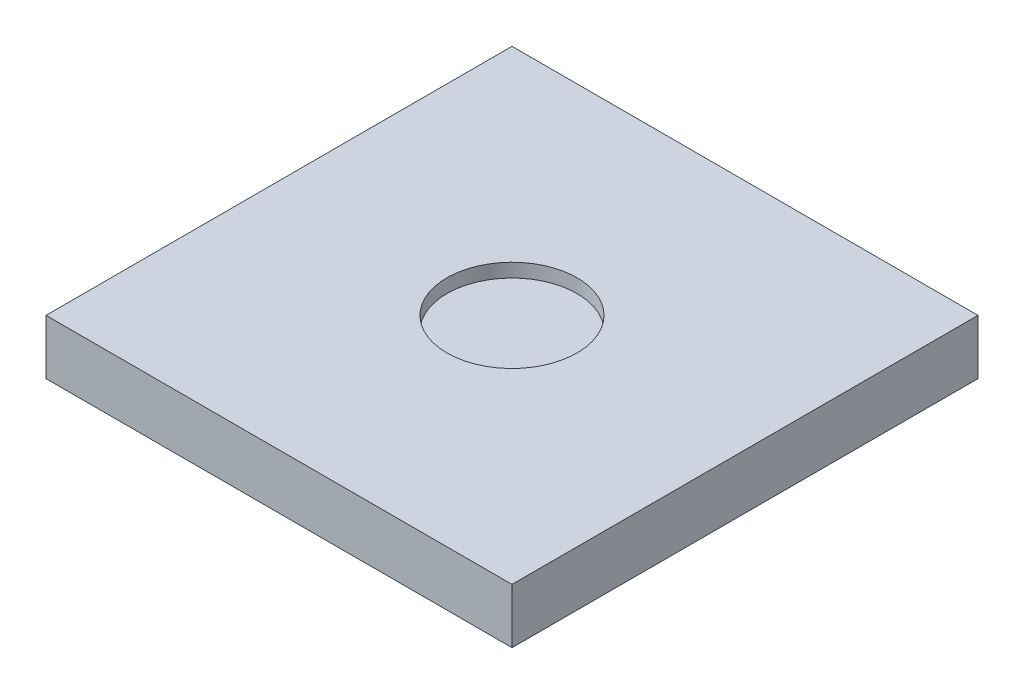
ISO-10303-21;
HEADER;
FILE_DESCRIPTION(('STEP AP214'),'2;1');
FILE_NAME('part.step','',(''),(''),'','','');
FILE_SCHEMA(('AUTOMOTIVE_DESIGN { 1 0 10303 214 1 1 1 1 }'));
ENDSEC;
DATA;
#1=APPLICATION_CONTEXT('core data for automotive mechanical design processes');
#2=APPLICATION_PROTOCOL_DEFINITION('international standard','automotive_design',2000,#1);
#3=PRODUCT_CONTEXT('',#1,'mechanical');
#4=PRODUCT('Part','Part','',(#3));
#5=PRODUCT_RELATED_PRODUCT_CATEGORY('part','',(#4));
#6=PRODUCT_DEFINITION_FORMATION('','',#4);
#7=PRODUCT_DEFINITION_CONTEXT('part definition',#1,'design');
#8=PRODUCT_DEFINITION('design','',#6,#7);
#9=PRODUCT_DEFINITION_SHAPE('','',#8);
#10=(LENGTH_UNIT() NAMED_UNIT(*) SI_UNIT(.MILLI.,.METRE.));
#11=(NAMED_UNIT(*) PLANE_ANGLE_UNIT() SI_UNIT($,.RADIAN.));
#12=(NAMED_UNIT(*) SI_UNIT($,.STERADIAN.) SOLID_ANGLE_UNIT());
#13=UNCERTAINTY_MEASURE_WITH_UNIT(LENGTH_MEASURE(1.E-05),#10,'distance_accuracy_value','');
#14=(GEOMETRIC_REPRESENTATION_CONTEXT(3) GLOBAL_UNCERTAINTY_ASSIGNED_CONTEXT((#13)) GLOBAL_UNIT_ASSIGNED_CONTEXT((#10,
#11,#12)) REPRESENTATION_CONTEXT('',''));
#15=CARTESIAN_POINT('',(0.,0.,0.));
#16=DIRECTION('',(0.,0.,1.));
#17=DIRECTION('',(1.,0.,0.));
#18=AXIS2_PLACEMENT_3D('',#15,#16,#17);
#19=CARTESIAN_POINT('',(-170.,40.,-170.));
#20=DIRECTION('',(1.,0.,0.));
#21=DIRECTION('',(0.,0.,-1.));
#22=AXIS2_PLACEMENT_3D('',#19,#20,#21);
#23=PLANE('',#22);
#24=DIRECTION('',(0.,0.,1.));
#25=VECTOR('',#24,1.);
#26=CARTESIAN_POINT('',(-170.,0.,-170.));
#27=LINE('',#26,#25);
#28=CARTESIAN_POINT('',(-170.,0.,-170.));
#29=VERTEX_POINT('',#28);
#30=CARTESIAN_POINT('',(-170.,0.,170.));
#31=VERTEX_POINT('',#30);
#32=EDGE_CURVE('E96',#29,#31,#27,.T.);
#33=ORIENTED_EDGE('',*,*,#32,.T.);
#34=DIRECTION('',(0.,-1.,0.));
#35=VECTOR('',#34,1.);
#36=CARTESIAN_POINT('',(-170.,40.,170.));
#37=LINE('',#36,#35);
#38=CARTESIAN_POINT('',(-170.,40.,170.));
#39=VERTEX_POINT('',#38);
#40=EDGE_CURVE('E11',#39,#31,#37,.T.);
#41=ORIENTED_EDGE('',*,*,#40,.F.);
#42=DIRECTION('',(0.,0.,1.));
#43=VECTOR('',#42,1.);
#44=CARTESIAN_POINT('',(-170.,40.,-170.));
#45=LINE('',#44,#43);
#46=CARTESIAN_POINT('',(-170.,40.,-170.));
#47=VERTEX_POINT('',#46);
#48=EDGE_CURVE('E84',#47,#39,#45,.T.);
#49=ORIENTED_EDGE('',*,*,#48,.F.);
#50=DIRECTION('',(0.,-1.,0.));
#51=VECTOR('',#50,1.);
#52=CARTESIAN_POINT('',(-170.,40.,-170.));
#53=LINE('',#52,#51);
#54=EDGE_CURVE('E92',#47,#29,#53,.T.);
#55=ORIENTED_EDGE('',*,*,#54,.T.);
#56=EDGE_LOOP('',(#33,#41,#49,#55));
#57=FACE_BOUND('',#56,.T.);
#58=ADVANCED_FACE('F33',(#57),#23,.F.);
#59=CARTESIAN_POINT('',(170.,40.,170.));
#60=DIRECTION('',(0.,0.,-1.));
#61=DIRECTION('',(-1.,0.,0.));
#62=AXIS2_PLACEMENT_3D('',#59,#60,#61);
#63=PLANE('',#62);
#64=DIRECTION('',(1.,0.,0.));
#65=VECTOR('',#64,1.);
#66=CARTESIAN_POINT('',(170.,0.,170.));
#67=LINE('',#66,#65);
#68=CARTESIAN_POINT('',(170.,0.,170.));
#69=VERTEX_POINT('',#68);
#70=EDGE_CURVE('E88',#31,#69,#67,.T.);
#71=ORIENTED_EDGE('',*,*,#70,.T.);
#72=DIRECTION('',(0.,-1.,0.));
#73=VECTOR('',#72,1.);
#74=CARTESIAN_POINT('',(170.,40.,170.));
#75=LINE('',#74,#73);
#76=CARTESIAN_POINT('',(170.,40.,170.));
#77=VERTEX_POINT('',#76);
#78=EDGE_CURVE('E41',#77,#69,#75,.T.);
#79=ORIENTED_EDGE('',*,*,#78,.F.);
#80=DIRECTION('',(1.,0.,0.));
#81=VECTOR('',#80,1.);
#82=CARTESIAN_POINT('',(170.,40.,170.));
#83=LINE('',#82,#81);
#84=EDGE_CURVE('E79',#39,#77,#83,.T.);
#85=ORIENTED_EDGE('',*,*,#84,.F.);
#86=ORIENTED_EDGE('',*,*,#40,.T.);
#87=EDGE_LOOP('',(#71,#79,#85,#86));
#88=FACE_BOUND('',#87,.T.);
#89=ADVANCED_FACE('F87',(#88),#63,.F.);
#90=CARTESIAN_POINT('',(170.,40.,-170.));
#91=DIRECTION('',(-1.,0.,0.));
#92=DIRECTION('',(0.,0.,1.));
#93=AXIS2_PLACEMENT_3D('',#90,#91,#92);
#94=PLANE('',#93);
#95=DIRECTION('',(0.,0.,-1.));
#96=VECTOR('',#95,1.);
#97=CARTESIAN_POINT('',(170.,0.,-170.));
#98=LINE('',#97,#96);
#99=CARTESIAN_POINT('',(170.,0.,-170.));
#100=VERTEX_POINT('',#99);
#101=EDGE_CURVE('E66',#69,#100,#98,.T.);
#102=ORIENTED_EDGE('',*,*,#101,.T.);
#103=DIRECTION('',(0.,-1.,0.));
#104=VECTOR('',#103,1.);
#105=CARTESIAN_POINT('',(170.,40.,-170.));
#106=LINE('',#105,#104);
#107=CARTESIAN_POINT('',(170.,40.,-170.));
#108=VERTEX_POINT('',#107);
#109=EDGE_CURVE('E89',#108,#100,#106,.T.);
#110=ORIENTED_EDGE('',*,*,#109,.F.);
#111=DIRECTION('',(0.,0.,-1.));
#112=VECTOR('',#111,1.);
#113=CARTESIAN_POINT('',(170.,40.,-170.));
#114=LINE('',#113,#112);
#115=EDGE_CURVE('E82',#77,#108,#114,.T.);
#116=ORIENTED_EDGE('',*,*,#115,.F.);
#117=ORIENTED_EDGE('',*,*,#78,.T.);
#118=EDGE_LOOP('',(#102,#110,#116,#117));
#119=FACE_BOUND('',#118,.T.);
#120=ADVANCED_FACE('F90',(#119),#94,.F.);
#121=CARTESIAN_POINT('',(170.,40.,-170.));
#122=DIRECTION('',(0.,0.,1.));
#123=DIRECTION('',(1.,0.,0.));
#124=AXIS2_PLACEMENT_3D('',#121,#122,#123);
#125=PLANE('',#124);
#126=DIRECTION('',(-1.,0.,0.));
#127=VECTOR('',#126,1.);
#128=CARTESIAN_POINT('',(170.,0.,-170.));
#129=LINE('',#128,#127);
#130=EDGE_CURVE('E72',#100,#29,#129,.T.);
#131=ORIENTED_EDGE('',*,*,#130,.T.);
#132=ORIENTED_EDGE('',*,*,#54,.F.);
#133=DIRECTION('',(-1.,0.,0.));
#134=VECTOR('',#133,1.);
#135=CARTESIAN_POINT('',(170.,40.,-170.));
#136=LINE('',#135,#134);
#137=EDGE_CURVE('E49',#108,#47,#136,.T.);
#138=ORIENTED_EDGE('',*,*,#137,.F.);
#139=ORIENTED_EDGE('',*,*,#109,.T.);
#140=EDGE_LOOP('',(#131,#132,#138,#139));
#141=FACE_BOUND('',#140,.T.);
#142=ADVANCED_FACE('F104',(#141),#125,.F.);
#143=CARTESIAN_POINT('',(0.,40.,0.));
#144=DIRECTION('',(0.,-1.,0.));
#145=DIRECTION('',(0.,0.,-1.));
#146=AXIS2_PLACEMENT_3D('',#143,#144,#145);
#147=PLANE('',#146);
#148=CARTESIAN_POINT('',(0.,40.,0.));
#149=DIRECTION('',(0.,1.,0.));
#150=DIRECTION('',(0.,0.,1.));
#151=AXIS2_PLACEMENT_3D('',#148,#149,#150);
#152=CIRCLE('',#151,47.5);
#153=CARTESIAN_POINT('',(0.,40.,47.5));
#154=VERTEX_POINT('',#153);
#155=EDGE_CURVE('E110',#154,#154,#152,.T.);
#156=ORIENTED_EDGE('',*,*,#155,.F.);
#157=EDGE_LOOP('',(#156));
#158=FACE_BOUND('',#157,.T.);
#159=ORIENTED_EDGE('',*,*,#48,.T.);
#160=ORIENTED_EDGE('',*,*,#84,.T.);
#161=ORIENTED_EDGE('',*,*,#115,.T.);
#162=ORIENTED_EDGE('',*,*,#137,.T.);
#163=EDGE_LOOP('',(#159,#160,#161,#162));
#164=FACE_BOUND('',#163,.T.);
#165=ADVANCED_FACE('F80',(#158,#164),#147,.F.);
#166=CARTESIAN_POINT('',(0.,0.,0.));
#167=DIRECTION('',(0.,-1.,0.));
#168=DIRECTION('',(0.,0.,-1.));
#169=AXIS2_PLACEMENT_3D('',#166,#167,#168);
#170=PLANE('',#169);
#171=ORIENTED_EDGE('',*,*,#32,.F.);
#172=ORIENTED_EDGE('',*,*,#130,.F.);
#173=ORIENTED_EDGE('',*,*,#101,.F.);
#174=ORIENTED_EDGE('',*,*,#70,.F.);
#175=EDGE_LOOP('',(#171,#172,#173,#174));
#176=FACE_BOUND('',#175,.T.);
#177=ADVANCED_FACE('F107',(#176),#170,.T.);
#178=CARTESIAN_POINT('',(0.,30.,0.));
#179=DIRECTION('',(0.,1.,0.));
#180=DIRECTION('',(0.,0.,1.));
#181=AXIS2_PLACEMENT_3D('',#178,#179,#180);
#182=CYLINDRICAL_SURFACE('',#181,47.5);
#183=CARTESIAN_POINT('',(0.,30.,0.));
#184=DIRECTION('',(0.,1.,0.));
#185=DIRECTION('',(0.,0.,1.));
#186=AXIS2_PLACEMENT_3D('',#183,#184,#185);
#187=CIRCLE('',#186,47.5);
#188=CARTESIAN_POINT('',(0.,30.,47.5));
#189=VERTEX_POINT('',#188);
#190=EDGE_CURVE('E99',#189,#189,#187,.T.);
#191=ORIENTED_EDGE('',*,*,#190,.F.);
#192=EDGE_LOOP('',(#191));
#193=FACE_BOUND('',#192,.T.);
#194=ORIENTED_EDGE('',*,*,#155,.T.);
#195=EDGE_LOOP('',(#194));
#196=FACE_BOUND('',#195,.T.);
#197=ADVANCED_FACE('F118',(#193,#196),#182,.F.);
#198=CARTESIAN_POINT('',(0.,30.,0.));
#199=DIRECTION('',(0.,1.,0.));
#200=DIRECTION('',(0.,0.,1.));
#201=AXIS2_PLACEMENT_3D('',#198,#199,#200);
#202=PLANE('',#201);
#203=ORIENTED_EDGE('',*,*,#190,.T.);
#204=EDGE_LOOP('',(#203));
#205=FACE_BOUND('',#204,.T.);
#206=ADVANCED_FACE('F116',(#205),#202,.T.);
#207=CLOSED_SHELL('',(#58,#89,#120,#142,#165,#177,#197,#206));
#208=MANIFOLD_SOLID_BREP('B2',#207);
#209=ADVANCED_BREP_SHAPE_REPRESENTATION('',(#18,#208),#14);
#210=SHAPE_DEFINITION_REPRESENTATION(#9,#209);
ENDSEC;
END-ISO-10303-21;
